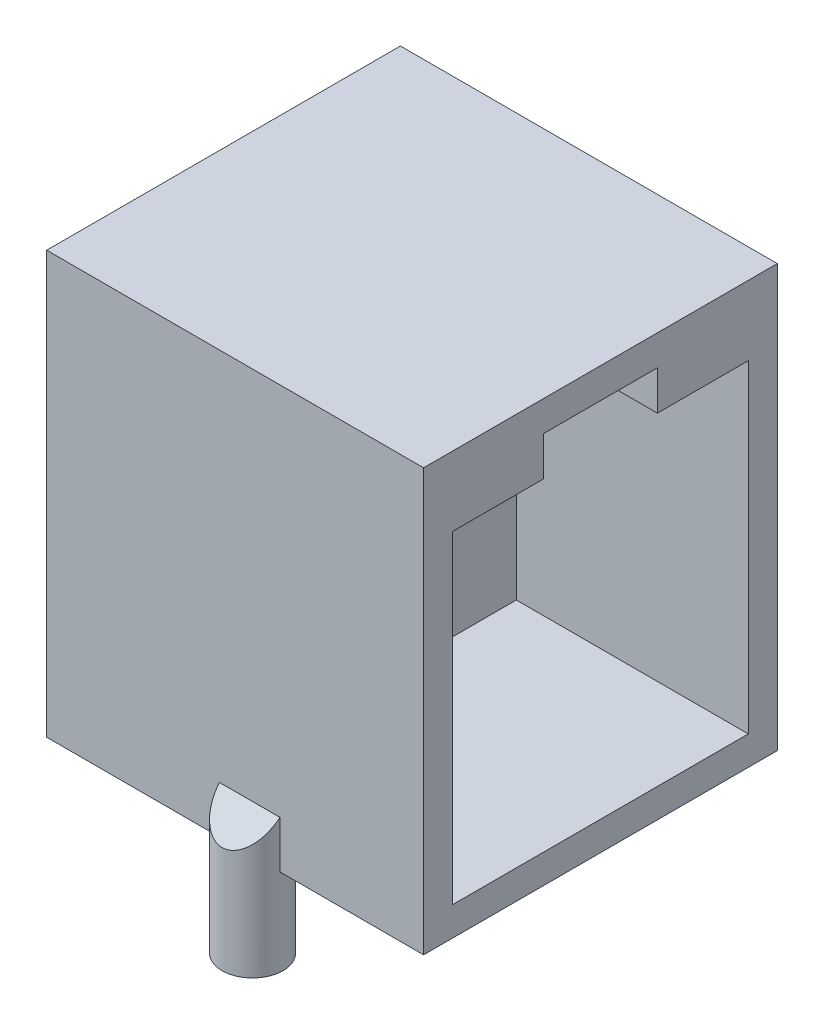
ISO-10303-21;
HEADER;
FILE_DESCRIPTION(('STEP AP214'),'2;1');
FILE_NAME('part.step','',(''),(''),'','','');
FILE_SCHEMA(('AUTOMOTIVE_DESIGN { 1 0 10303 214 1 1 1 1 }'));
ENDSEC;
DATA;
#1=APPLICATION_CONTEXT('core data for automotive mechanical design processes');
#2=APPLICATION_PROTOCOL_DEFINITION('international standard','automotive_design',2000,#1);
#3=PRODUCT_CONTEXT('',#1,'mechanical');
#4=PRODUCT('Part','Part','',(#3));
#5=PRODUCT_RELATED_PRODUCT_CATEGORY('part','',(#4));
#6=PRODUCT_DEFINITION_FORMATION('','',#4);
#7=PRODUCT_DEFINITION_CONTEXT('part definition',#1,'design');
#8=PRODUCT_DEFINITION('design','',#6,#7);
#9=PRODUCT_DEFINITION_SHAPE('','',#8);
#10=(LENGTH_UNIT() NAMED_UNIT(*) SI_UNIT(.MILLI.,.METRE.));
#11=(NAMED_UNIT(*) PLANE_ANGLE_UNIT() SI_UNIT($,.RADIAN.));
#12=(NAMED_UNIT(*) SI_UNIT($,.STERADIAN.) SOLID_ANGLE_UNIT());
#13=UNCERTAINTY_MEASURE_WITH_UNIT(LENGTH_MEASURE(1.E-05),#10,'distance_accuracy_value','');
#14=(GEOMETRIC_REPRESENTATION_CONTEXT(3) GLOBAL_UNCERTAINTY_ASSIGNED_CONTEXT((#13)) GLOBAL_UNIT_ASSIGNED_CONTEXT((#10,
#11,#12)) REPRESENTATION_CONTEXT('',''));
#15=CARTESIAN_POINT('',(0.,0.,0.));
#16=DIRECTION('',(0.,0.,1.));
#17=DIRECTION('',(1.,0.,0.));
#18=AXIS2_PLACEMENT_3D('',#15,#16,#17);
#19=CARTESIAN_POINT('',(0.,14.55,0.));
#20=DIRECTION('',(1.,0.,0.));
#21=DIRECTION('',(0.,0.,-1.));
#22=AXIS2_PLACEMENT_3D('',#19,#20,#21);
#23=PLANE('',#22);
#24=DIRECTION('',(0.,0.,1.));
#25=VECTOR('',#24,1.);
#26=CARTESIAN_POINT('',(0.,0.,0.));
#27=LINE('',#26,#25);
#28=CARTESIAN_POINT('',(0.,0.,-12.2));
#29=VERTEX_POINT('',#28);
#30=CARTESIAN_POINT('',(0.,0.,0.));
#31=VERTEX_POINT('',#30);
#32=EDGE_CURVE('E233',#29,#31,#27,.T.);
#33=ORIENTED_EDGE('',*,*,#32,.T.);
#34=DIRECTION('',(0.,-1.,0.));
#35=VECTOR('',#34,1.);
#36=CARTESIAN_POINT('',(0.,14.55,0.));
#37=LINE('',#36,#35);
#38=CARTESIAN_POINT('',(0.,14.55,0.));
#39=VERTEX_POINT('',#38);
#40=EDGE_CURVE('E238',#39,#31,#37,.T.);
#41=ORIENTED_EDGE('',*,*,#40,.F.);
#42=DIRECTION('',(0.,0.,1.));
#43=VECTOR('',#42,1.);
#44=CARTESIAN_POINT('',(0.,14.55,0.));
#45=LINE('',#44,#43);
#46=CARTESIAN_POINT('',(0.,14.55,-12.2));
#47=VERTEX_POINT('',#46);
#48=EDGE_CURVE('E239',#47,#39,#45,.T.);
#49=ORIENTED_EDGE('',*,*,#48,.F.);
#50=DIRECTION('',(0.,-1.,0.));
#51=VECTOR('',#50,1.);
#52=CARTESIAN_POINT('',(0.,14.55,-12.2));
#53=LINE('',#52,#51);
#54=EDGE_CURVE('E249',#47,#29,#53,.T.);
#55=ORIENTED_EDGE('',*,*,#54,.T.);
#56=EDGE_LOOP('',(#33,#41,#49,#55));
#57=FACE_BOUND('',#56,.T.);
#58=ADVANCED_FACE('F37',(#57),#23,.F.);
#59=CARTESIAN_POINT('',(0.,14.55,0.));
#60=DIRECTION('',(0.,0.,-1.));
#61=DIRECTION('',(-1.,0.,0.));
#62=AXIS2_PLACEMENT_3D('',#59,#60,#61);
#63=PLANE('',#62);
#64=DIRECTION('',(1.,0.,0.));
#65=VECTOR('',#64,1.);
#66=CARTESIAN_POINT('',(8.04522724801834,1.63000000000003,0.));
#67=LINE('',#66,#65);
#68=CARTESIAN_POINT('',(5.95477275198166,1.63000000000003,0.));
#69=VERTEX_POINT('',#68);
#70=CARTESIAN_POINT('',(8.04522724801834,1.63000000000003,0.));
#71=VERTEX_POINT('',#70);
#72=EDGE_CURVE('E271',#69,#71,#67,.T.);
#73=ORIENTED_EDGE('',*,*,#72,.T.);
#74=DIRECTION('',(0.,1.,0.));
#75=VECTOR('',#74,1.);
#76=CARTESIAN_POINT('',(8.04522724801834,1.63000000000003,0.));
#77=LINE('',#76,#75);
#78=CARTESIAN_POINT('',(8.04522724801834,0.,0.));
#79=VERTEX_POINT('',#78);
#80=EDGE_CURVE('E274',#71,#79,#77,.F.);
#81=ORIENTED_EDGE('',*,*,#80,.T.);
#82=DIRECTION('',(1.,0.,0.));
#83=VECTOR('',#82,1.);
#84=CARTESIAN_POINT('',(0.,0.,0.));
#85=LINE('',#84,#83);
#86=CARTESIAN_POINT('',(13.,0.,0.));
#87=VERTEX_POINT('',#86);
#88=EDGE_CURVE('E252',#79,#87,#85,.T.);
#89=ORIENTED_EDGE('',*,*,#88,.T.);
#90=DIRECTION('',(0.,-1.,0.));
#91=VECTOR('',#90,1.);
#92=CARTESIAN_POINT('',(13.,14.55,0.));
#93=LINE('',#92,#91);
#94=CARTESIAN_POINT('',(13.,14.55,0.));
#95=VERTEX_POINT('',#94);
#96=EDGE_CURVE('E265',#95,#87,#93,.T.);
#97=ORIENTED_EDGE('',*,*,#96,.F.);
#98=DIRECTION('',(1.,0.,0.));
#99=VECTOR('',#98,1.);
#100=CARTESIAN_POINT('',(0.,14.55,0.));
#101=LINE('',#100,#99);
#102=EDGE_CURVE('E242',#39,#95,#101,.T.);
#103=ORIENTED_EDGE('',*,*,#102,.F.);
#104=ORIENTED_EDGE('',*,*,#40,.T.);
#105=CARTESIAN_POINT('',(5.95477275198166,0.,0.));
#106=VERTEX_POINT('',#105);
#107=EDGE_CURVE('E253',#31,#106,#85,.T.);
#108=ORIENTED_EDGE('',*,*,#107,.T.);
#109=DIRECTION('',(0.,1.,0.));
#110=VECTOR('',#109,1.);
#111=CARTESIAN_POINT('',(5.95477275198166,0.,0.));
#112=LINE('',#111,#110);
#113=EDGE_CURVE('E237',#106,#69,#112,.T.);
#114=ORIENTED_EDGE('',*,*,#113,.T.);
#115=EDGE_LOOP('',(#73,#81,#89,#97,#103,#104,#108,#114));
#116=FACE_BOUND('',#115,.T.);
#117=ADVANCED_FACE('F315',(#116),#63,.F.);
#118=CARTESIAN_POINT('',(13.,14.55,0.));
#119=DIRECTION('',(-1.,0.,0.));
#120=DIRECTION('',(0.,0.,1.));
#121=AXIS2_PLACEMENT_3D('',#118,#119,#120);
#122=PLANE('',#121);
#123=DIRECTION('',(0.,1.,0.));
#124=VECTOR('',#123,1.);
#125=CARTESIAN_POINT('',(13.,13.5034894813453,-8.06507473634951));
#126=LINE('',#125,#124);
#127=CARTESIAN_POINT('',(13.,12.1496378925986,-8.06507473634951));
#128=VERTEX_POINT('',#127);
#129=CARTESIAN_POINT('',(13.,13.5034894813453,-8.06507473634951));
#130=VERTEX_POINT('',#129);
#131=EDGE_CURVE('E196',#128,#130,#126,.T.);
#132=ORIENTED_EDGE('',*,*,#131,.F.);
#133=DIRECTION('',(0.,0.,1.));
#134=VECTOR('',#133,1.);
#135=CARTESIAN_POINT('',(13.,12.1496378925986,-8.06507473634951));
#136=LINE('',#135,#134);
#137=CARTESIAN_POINT('',(13.,12.1496378925986,-11.1997281323746));
#138=VERTEX_POINT('',#137);
#139=EDGE_CURVE('E158',#138,#128,#136,.T.);
#140=ORIENTED_EDGE('',*,*,#139,.F.);
#141=DIRECTION('',(0.,1.,0.));
#142=VECTOR('',#141,1.);
#143=CARTESIAN_POINT('',(13.,1.0002718676254,-11.1997281323746));
#144=LINE('',#143,#142);
#145=CARTESIAN_POINT('',(13.,1.0002718676254,-11.1997281323746));
#146=VERTEX_POINT('',#145);
#147=EDGE_CURVE('E176',#146,#138,#144,.T.);
#148=ORIENTED_EDGE('',*,*,#147,.F.);
#149=DIRECTION('',(0.,0.,-1.));
#150=VECTOR('',#149,1.);
#151=CARTESIAN_POINT('',(13.,1.0002718676254,-1.0002718676254));
#152=LINE('',#151,#150);
#153=CARTESIAN_POINT('',(13.,1.0002718676254,-1.0002718676254));
#154=VERTEX_POINT('',#153);
#155=EDGE_CURVE('E179',#154,#146,#152,.T.);
#156=ORIENTED_EDGE('',*,*,#155,.F.);
#157=DIRECTION('',(0.,-1.,0.));
#158=VECTOR('',#157,1.);
#159=CARTESIAN_POINT('',(13.,12.1496378925986,-1.0002718676254));
#160=LINE('',#159,#158);
#161=CARTESIAN_POINT('',(13.,12.1496378925986,-1.0002718676254));
#162=VERTEX_POINT('',#161);
#163=EDGE_CURVE('E207',#162,#154,#160,.T.);
#164=ORIENTED_EDGE('',*,*,#163,.F.);
#165=DIRECTION('',(0.,0.,1.));
#166=VECTOR('',#165,1.);
#167=CARTESIAN_POINT('',(13.,12.1496378925986,-1.0002718676254));
#168=LINE('',#167,#166);
#169=CARTESIAN_POINT('',(13.,12.1496378925986,-4.13492526365049));
#170=VERTEX_POINT('',#169);
#171=EDGE_CURVE('E204',#170,#162,#168,.T.);
#172=ORIENTED_EDGE('',*,*,#171,.F.);
#173=DIRECTION('',(0.,-1.,0.));
#174=VECTOR('',#173,1.);
#175=CARTESIAN_POINT('',(13.,12.1496378925986,-4.13492526365049));
#176=LINE('',#175,#174);
#177=CARTESIAN_POINT('',(13.,13.5034894813453,-4.13492526365049));
#178=VERTEX_POINT('',#177);
#179=EDGE_CURVE('E201',#178,#170,#176,.T.);
#180=ORIENTED_EDGE('',*,*,#179,.F.);
#181=DIRECTION('',(0.,0.,1.));
#182=VECTOR('',#181,1.);
#183=CARTESIAN_POINT('',(13.,13.5034894813453,-4.13492526365049));
#184=LINE('',#183,#182);
#185=EDGE_CURVE('E198',#130,#178,#184,.T.);
#186=ORIENTED_EDGE('',*,*,#185,.F.);
#187=EDGE_LOOP('',(#132,#140,#148,#156,#164,#172,#180,#186));
#188=FACE_BOUND('',#187,.T.);
#189=DIRECTION('',(0.,0.,-1.));
#190=VECTOR('',#189,1.);
#191=CARTESIAN_POINT('',(13.,0.,0.));
#192=LINE('',#191,#190);
#193=CARTESIAN_POINT('',(13.,0.,-12.2));
#194=VERTEX_POINT('',#193);
#195=EDGE_CURVE('E256',#87,#194,#192,.T.);
#196=ORIENTED_EDGE('',*,*,#195,.T.);
#197=DIRECTION('',(0.,-1.,0.));
#198=VECTOR('',#197,1.);
#199=CARTESIAN_POINT('',(13.,14.55,-12.2));
#200=LINE('',#199,#198);
#201=CARTESIAN_POINT('',(13.,14.55,-12.2));
#202=VERTEX_POINT('',#201);
#203=EDGE_CURVE('E262',#202,#194,#200,.T.);
#204=ORIENTED_EDGE('',*,*,#203,.F.);
#205=DIRECTION('',(0.,0.,-1.));
#206=VECTOR('',#205,1.);
#207=CARTESIAN_POINT('',(13.,14.55,0.));
#208=LINE('',#207,#206);
#209=EDGE_CURVE('E245',#95,#202,#208,.T.);
#210=ORIENTED_EDGE('',*,*,#209,.F.);
#211=ORIENTED_EDGE('',*,*,#96,.T.);
#212=EDGE_LOOP('',(#196,#204,#210,#211));
#213=FACE_BOUND('',#212,.T.);
#214=ADVANCED_FACE('F304',(#188,#213),#122,.F.);
#215=CARTESIAN_POINT('',(0.,14.55,-12.2));
#216=DIRECTION('',(0.,0.,1.));
#217=DIRECTION('',(1.,0.,0.));
#218=AXIS2_PLACEMENT_3D('',#215,#216,#217);
#219=PLANE('',#218);
#220=DIRECTION('',(-1.,0.,0.));
#221=VECTOR('',#220,1.);
#222=CARTESIAN_POINT('',(5.95477275198166,1.63000000000003,-12.2));
#223=LINE('',#222,#221);
#224=CARTESIAN_POINT('',(8.04522724801835,1.63000000000003,-12.2));
#225=VERTEX_POINT('',#224);
#226=CARTESIAN_POINT('',(5.95477275198166,1.63000000000003,-12.2));
#227=VERTEX_POINT('',#226);
#228=EDGE_CURVE('E277',#225,#227,#223,.T.);
#229=ORIENTED_EDGE('',*,*,#228,.T.);
#230=DIRECTION('',(0.,1.,0.));
#231=VECTOR('',#230,1.);
#232=CARTESIAN_POINT('',(5.95477275198166,1.63000000000003,-12.2));
#233=LINE('',#232,#231);
#234=CARTESIAN_POINT('',(5.95477275198166,0.,-12.2));
#235=VERTEX_POINT('',#234);
#236=EDGE_CURVE('E280',#227,#235,#233,.F.);
#237=ORIENTED_EDGE('',*,*,#236,.T.);
#238=DIRECTION('',(-1.,0.,0.));
#239=VECTOR('',#238,1.);
#240=CARTESIAN_POINT('',(0.,0.,-12.2));
#241=LINE('',#240,#239);
#242=EDGE_CURVE('E258',#235,#29,#241,.T.);
#243=ORIENTED_EDGE('',*,*,#242,.T.);
#244=ORIENTED_EDGE('',*,*,#54,.F.);
#245=DIRECTION('',(-1.,0.,0.));
#246=VECTOR('',#245,1.);
#247=CARTESIAN_POINT('',(0.,14.55,-12.2));
#248=LINE('',#247,#246);
#249=EDGE_CURVE('E247',#202,#47,#248,.T.);
#250=ORIENTED_EDGE('',*,*,#249,.F.);
#251=ORIENTED_EDGE('',*,*,#203,.T.);
#252=CARTESIAN_POINT('',(8.04522724801835,0.,-12.2));
#253=VERTEX_POINT('',#252);
#254=EDGE_CURVE('E243',#194,#253,#241,.T.);
#255=ORIENTED_EDGE('',*,*,#254,.T.);
#256=DIRECTION('',(0.,1.,0.));
#257=VECTOR('',#256,1.);
#258=CARTESIAN_POINT('',(8.04522724801835,0.,-12.2));
#259=LINE('',#258,#257);
#260=EDGE_CURVE('E54',#253,#225,#259,.T.);
#261=ORIENTED_EDGE('',*,*,#260,.T.);
#262=EDGE_LOOP('',(#229,#237,#243,#244,#250,#251,#255,#261));
#263=FACE_BOUND('',#262,.T.);
#264=ADVANCED_FACE('F283',(#263),#219,.F.);
#265=CARTESIAN_POINT('',(0.,14.55,0.));
#266=DIRECTION('',(0.,-1.,0.));
#267=DIRECTION('',(0.,0.,-1.));
#268=AXIS2_PLACEMENT_3D('',#265,#266,#267);
#269=PLANE('',#268);
#270=ORIENTED_EDGE('',*,*,#48,.T.);
#271=ORIENTED_EDGE('',*,*,#102,.T.);
#272=ORIENTED_EDGE('',*,*,#209,.T.);
#273=ORIENTED_EDGE('',*,*,#249,.T.);
#274=EDGE_LOOP('',(#270,#271,#272,#273));
#275=FACE_BOUND('',#274,.T.);
#276=ADVANCED_FACE('F300',(#275),#269,.F.);
#277=CARTESIAN_POINT('',(0.,0.,0.));
#278=DIRECTION('',(0.,-1.,0.));
#279=DIRECTION('',(0.,0.,-1.));
#280=AXIS2_PLACEMENT_3D('',#277,#278,#279);
#281=PLANE('',#280);
#282=ORIENTED_EDGE('',*,*,#242,.F.);
#283=CARTESIAN_POINT('',(7.,0.,-12.1));
#284=DIRECTION('',(0.,-1.,0.));
#285=DIRECTION('',(0.,0.,-1.));
#286=AXIS2_PLACEMENT_3D('',#283,#284,#285);
#287=CIRCLE('',#286,1.05);
#288=EDGE_CURVE('E214',#253,#235,#287,.T.);
#289=ORIENTED_EDGE('',*,*,#288,.F.);
#290=ORIENTED_EDGE('',*,*,#254,.F.);
#291=ORIENTED_EDGE('',*,*,#195,.F.);
#292=ORIENTED_EDGE('',*,*,#88,.F.);
#293=CARTESIAN_POINT('',(7.,0.,-0.0999999999999994));
#294=DIRECTION('',(0.,-1.,0.));
#295=DIRECTION('',(0.,0.,-1.));
#296=AXIS2_PLACEMENT_3D('',#293,#294,#295);
#297=CIRCLE('',#296,1.05);
#298=EDGE_CURVE('E234',#106,#79,#297,.T.);
#299=ORIENTED_EDGE('',*,*,#298,.F.);
#300=ORIENTED_EDGE('',*,*,#107,.F.);
#301=ORIENTED_EDGE('',*,*,#32,.F.);
#302=EDGE_LOOP('',(#282,#289,#290,#291,#292,#299,#300,#301));
#303=FACE_BOUND('',#302,.T.);
#304=ADVANCED_FACE('F292',(#303),#281,.T.);
#305=CARTESIAN_POINT('',(7.,-3.,-0.0999999999999994));
#306=DIRECTION('',(0.,1.,0.));
#307=DIRECTION('',(0.,0.,1.));
#308=AXIS2_PLACEMENT_3D('',#305,#306,#307);
#309=CYLINDRICAL_SURFACE('',#308,1.05);
#310=CARTESIAN_POINT('',(7.,-3.,-0.0999999999999994));
#311=DIRECTION('',(0.,-1.,0.));
#312=DIRECTION('',(0.,0.,-1.));
#313=AXIS2_PLACEMENT_3D('',#310,#311,#312);
#314=CIRCLE('',#313,1.05);
#315=CARTESIAN_POINT('',(7.,-3.,-1.15));
#316=VERTEX_POINT('',#315);
#317=EDGE_CURVE('E229',#316,#316,#314,.T.);
#318=ORIENTED_EDGE('',*,*,#317,.F.);
#319=EDGE_LOOP('',(#318));
#320=FACE_BOUND('',#319,.T.);
#321=ORIENTED_EDGE('',*,*,#80,.F.);
#322=CARTESIAN_POINT('',(7.,1.73000000000003,-0.0999999999999994));
#323=DIRECTION('',(0.,0.707106781186544,0.707106781186551));
#324=DIRECTION('',(0.,0.707106781186551,-0.707106781186544));
#325=AXIS2_PLACEMENT_3D('',#322,#323,#324);
#326=ELLIPSE('',#325,1.48492424049176,1.05);
#327=EDGE_CURVE('E47',#71,#69,#326,.F.);
#328=ORIENTED_EDGE('',*,*,#327,.T.);
#329=ORIENTED_EDGE('',*,*,#113,.F.);
#330=ORIENTED_EDGE('',*,*,#298,.T.);
#331=EDGE_LOOP('',(#321,#328,#329,#330));
#332=FACE_BOUND('',#331,.T.);
#333=ADVANCED_FACE('F335',(#320,#332),#309,.T.);
#334=CARTESIAN_POINT('',(7.,-3.,-0.0999999999999994));
#335=DIRECTION('',(0.,-1.,0.));
#336=DIRECTION('',(0.,0.,-1.));
#337=AXIS2_PLACEMENT_3D('',#334,#335,#336);
#338=PLANE('',#337);
#339=ORIENTED_EDGE('',*,*,#317,.T.);
#340=EDGE_LOOP('',(#339));
#341=FACE_BOUND('',#340,.T.);
#342=ADVANCED_FACE('F340',(#341),#338,.T.);
#343=CARTESIAN_POINT('',(7.,-3.,-12.1));
#344=DIRECTION('',(0.,1.,0.));
#345=DIRECTION('',(0.,0.,1.));
#346=AXIS2_PLACEMENT_3D('',#343,#344,#345);
#347=CYLINDRICAL_SURFACE('',#346,1.05);
#348=CARTESIAN_POINT('',(7.,-3.,-12.1));
#349=DIRECTION('',(0.,-1.,0.));
#350=DIRECTION('',(0.,0.,-1.));
#351=AXIS2_PLACEMENT_3D('',#348,#349,#350);
#352=CIRCLE('',#351,1.05);
#353=CARTESIAN_POINT('',(7.,-3.,-13.15));
#354=VERTEX_POINT('',#353);
#355=EDGE_CURVE('E226',#354,#354,#352,.T.);
#356=ORIENTED_EDGE('',*,*,#355,.F.);
#357=EDGE_LOOP('',(#356));
#358=FACE_BOUND('',#357,.T.);
#359=ORIENTED_EDGE('',*,*,#288,.T.);
#360=ORIENTED_EDGE('',*,*,#236,.F.);
#361=CARTESIAN_POINT('',(7.,1.73000000000003,-12.1));
#362=DIRECTION('',(0.,0.707106781186544,-0.707106781186551));
#363=DIRECTION('',(0.,0.707106781186551,0.707106781186544));
#364=AXIS2_PLACEMENT_3D('',#361,#362,#363);
#365=ELLIPSE('',#364,1.48492424049176,1.05);
#366=EDGE_CURVE('E11',#227,#225,#365,.F.);
#367=ORIENTED_EDGE('',*,*,#366,.T.);
#368=ORIENTED_EDGE('',*,*,#260,.F.);
#369=EDGE_LOOP('',(#359,#360,#367,#368));
#370=FACE_BOUND('',#369,.T.);
#371=ADVANCED_FACE('F288',(#358,#370),#347,.T.);
#372=CARTESIAN_POINT('',(7.,-3.,-12.1));
#373=DIRECTION('',(0.,-1.,0.));
#374=DIRECTION('',(0.,0.,-1.));
#375=AXIS2_PLACEMENT_3D('',#372,#373,#374);
#376=PLANE('',#375);
#377=ORIENTED_EDGE('',*,*,#355,.T.);
#378=EDGE_LOOP('',(#377));
#379=FACE_BOUND('',#378,.T.);
#380=ADVANCED_FACE('F347',(#379),#376,.T.);
#381=CARTESIAN_POINT('',(5.,12.1496378925986,-8.06507473634951));
#382=DIRECTION('',(0.,1.,0.));
#383=DIRECTION('',(0.,0.,1.));
#384=AXIS2_PLACEMENT_3D('',#381,#382,#383);
#385=PLANE('',#384);
#386=ORIENTED_EDGE('',*,*,#139,.T.);
#387=DIRECTION('',(1.,0.,0.));
#388=VECTOR('',#387,1.);
#389=CARTESIAN_POINT('',(5.,12.1496378925986,-8.06507473634951));
#390=LINE('',#389,#388);
#391=CARTESIAN_POINT('',(5.,12.1496378925986,-8.06507473634951));
#392=VERTEX_POINT('',#391);
#393=EDGE_CURVE('E151',#392,#128,#390,.T.);
#394=ORIENTED_EDGE('',*,*,#393,.F.);
#395=DIRECTION('',(0.,0.,1.));
#396=VECTOR('',#395,1.);
#397=CARTESIAN_POINT('',(5.,12.1496378925986,-8.06507473634951));
#398=LINE('',#397,#396);
#399=CARTESIAN_POINT('',(5.,12.1496378925986,-11.1997281323746));
#400=VERTEX_POINT('',#399);
#401=EDGE_CURVE('E155',#400,#392,#398,.T.);
#402=ORIENTED_EDGE('',*,*,#401,.F.);
#403=DIRECTION('',(1.,0.,0.));
#404=VECTOR('',#403,1.);
#405=CARTESIAN_POINT('',(5.,12.1496378925986,-11.1997281323746));
#406=LINE('',#405,#404);
#407=EDGE_CURVE('E212',#400,#138,#406,.T.);
#408=ORIENTED_EDGE('',*,*,#407,.T.);
#409=EDGE_LOOP('',(#386,#394,#402,#408));
#410=FACE_BOUND('',#409,.T.);
#411=ADVANCED_FACE('F153',(#410),#385,.F.);
#412=CARTESIAN_POINT('',(5.,1.0002718676254,-11.1997281323746));
#413=DIRECTION('',(0.,0.,-1.));
#414=DIRECTION('',(-1.,0.,0.));
#415=AXIS2_PLACEMENT_3D('',#412,#413,#414);
#416=PLANE('',#415);
#417=ORIENTED_EDGE('',*,*,#147,.T.);
#418=ORIENTED_EDGE('',*,*,#407,.F.);
#419=DIRECTION('',(0.,1.,0.));
#420=VECTOR('',#419,1.);
#421=CARTESIAN_POINT('',(5.,1.0002718676254,-11.1997281323746));
#422=LINE('',#421,#420);
#423=CARTESIAN_POINT('',(5.,1.0002718676254,-11.1997281323746));
#424=VERTEX_POINT('',#423);
#425=EDGE_CURVE('E163',#424,#400,#422,.T.);
#426=ORIENTED_EDGE('',*,*,#425,.F.);
#427=DIRECTION('',(1.,0.,0.));
#428=VECTOR('',#427,1.);
#429=CARTESIAN_POINT('',(5.,1.0002718676254,-11.1997281323746));
#430=LINE('',#429,#428);
#431=EDGE_CURVE('E215',#424,#146,#430,.T.);
#432=ORIENTED_EDGE('',*,*,#431,.T.);
#433=EDGE_LOOP('',(#417,#418,#426,#432));
#434=FACE_BOUND('',#433,.T.);
#435=ADVANCED_FACE('F354',(#434),#416,.F.);
#436=CARTESIAN_POINT('',(5.,1.0002718676254,-1.0002718676254));
#437=DIRECTION('',(0.,-1.,0.));
#438=DIRECTION('',(0.,0.,-1.));
#439=AXIS2_PLACEMENT_3D('',#436,#437,#438);
#440=PLANE('',#439);
#441=ORIENTED_EDGE('',*,*,#155,.T.);
#442=ORIENTED_EDGE('',*,*,#431,.F.);
#443=DIRECTION('',(0.,0.,-1.));
#444=VECTOR('',#443,1.);
#445=CARTESIAN_POINT('',(5.,1.0002718676254,-1.0002718676254));
#446=LINE('',#445,#444);
#447=CARTESIAN_POINT('',(5.,1.0002718676254,-1.0002718676254));
#448=VERTEX_POINT('',#447);
#449=EDGE_CURVE('E192',#448,#424,#446,.T.);
#450=ORIENTED_EDGE('',*,*,#449,.F.);
#451=DIRECTION('',(1.,0.,0.));
#452=VECTOR('',#451,1.);
#453=CARTESIAN_POINT('',(5.,1.0002718676254,-1.0002718676254));
#454=LINE('',#453,#452);
#455=EDGE_CURVE('E217',#448,#154,#454,.T.);
#456=ORIENTED_EDGE('',*,*,#455,.T.);
#457=EDGE_LOOP('',(#441,#442,#450,#456));
#458=FACE_BOUND('',#457,.T.);
#459=ADVANCED_FACE('F372',(#458),#440,.F.);
#460=CARTESIAN_POINT('',(5.,12.1496378925986,-1.0002718676254));
#461=DIRECTION('',(0.,0.,1.));
#462=DIRECTION('',(0.,-1.,0.));
#463=AXIS2_PLACEMENT_3D('',#460,#461,#462);
#464=PLANE('',#463);
#465=ORIENTED_EDGE('',*,*,#163,.T.);
#466=ORIENTED_EDGE('',*,*,#455,.F.);
#467=DIRECTION('',(0.,-1.,0.));
#468=VECTOR('',#467,1.);
#469=CARTESIAN_POINT('',(5.,12.1496378925986,-1.0002718676254));
#470=LINE('',#469,#468);
#471=CARTESIAN_POINT('',(5.,12.1496378925986,-1.0002718676254));
#472=VERTEX_POINT('',#471);
#473=EDGE_CURVE('E189',#472,#448,#470,.T.);
#474=ORIENTED_EDGE('',*,*,#473,.F.);
#475=DIRECTION('',(1.,0.,0.));
#476=VECTOR('',#475,1.);
#477=CARTESIAN_POINT('',(5.,12.1496378925986,-1.0002718676254));
#478=LINE('',#477,#476);
#479=EDGE_CURVE('E219',#472,#162,#478,.T.);
#480=ORIENTED_EDGE('',*,*,#479,.T.);
#481=EDGE_LOOP('',(#465,#466,#474,#480));
#482=FACE_BOUND('',#481,.T.);
#483=ADVANCED_FACE('F368',(#482),#464,.F.);
#484=CARTESIAN_POINT('',(5.,12.1496378925986,-1.0002718676254));
#485=DIRECTION('',(0.,1.,0.));
#486=DIRECTION('',(0.,0.,1.));
#487=AXIS2_PLACEMENT_3D('',#484,#485,#486);
#488=PLANE('',#487);
#489=ORIENTED_EDGE('',*,*,#171,.T.);
#490=ORIENTED_EDGE('',*,*,#479,.F.);
#491=DIRECTION('',(0.,0.,1.));
#492=VECTOR('',#491,1.);
#493=CARTESIAN_POINT('',(5.,12.1496378925986,-1.0002718676254));
#494=LINE('',#493,#492);
#495=CARTESIAN_POINT('',(5.,12.1496378925986,-4.13492526365049));
#496=VERTEX_POINT('',#495);
#497=EDGE_CURVE('E186',#496,#472,#494,.T.);
#498=ORIENTED_EDGE('',*,*,#497,.F.);
#499=DIRECTION('',(1.,0.,0.));
#500=VECTOR('',#499,1.);
#501=CARTESIAN_POINT('',(5.,12.1496378925986,-4.13492526365049));
#502=LINE('',#501,#500);
#503=EDGE_CURVE('E221',#496,#170,#502,.T.);
#504=ORIENTED_EDGE('',*,*,#503,.T.);
#505=EDGE_LOOP('',(#489,#490,#498,#504));
#506=FACE_BOUND('',#505,.T.);
#507=ADVANCED_FACE('F364',(#506),#488,.F.);
#508=CARTESIAN_POINT('',(5.,12.1496378925986,-4.13492526365049));
#509=DIRECTION('',(0.,0.,1.));
#510=DIRECTION('',(1.,0.,0.));
#511=AXIS2_PLACEMENT_3D('',#508,#509,#510);
#512=PLANE('',#511);
#513=ORIENTED_EDGE('',*,*,#179,.T.);
#514=ORIENTED_EDGE('',*,*,#503,.F.);
#515=DIRECTION('',(0.,-1.,0.));
#516=VECTOR('',#515,1.);
#517=CARTESIAN_POINT('',(5.,12.1496378925986,-4.13492526365049));
#518=LINE('',#517,#516);
#519=CARTESIAN_POINT('',(5.,13.5034894813453,-4.13492526365049));
#520=VERTEX_POINT('',#519);
#521=EDGE_CURVE('E183',#520,#496,#518,.T.);
#522=ORIENTED_EDGE('',*,*,#521,.F.);
#523=DIRECTION('',(1.,0.,0.));
#524=VECTOR('',#523,1.);
#525=CARTESIAN_POINT('',(5.,13.5034894813453,-4.13492526365049));
#526=LINE('',#525,#524);
#527=EDGE_CURVE('E223',#520,#178,#526,.T.);
#528=ORIENTED_EDGE('',*,*,#527,.T.);
#529=EDGE_LOOP('',(#513,#514,#522,#528));
#530=FACE_BOUND('',#529,.T.);
#531=ADVANCED_FACE('F360',(#530),#512,.F.);
#532=CARTESIAN_POINT('',(5.,13.5034894813453,-4.13492526365049));
#533=DIRECTION('',(0.,1.,0.));
#534=DIRECTION('',(0.,0.,1.));
#535=AXIS2_PLACEMENT_3D('',#532,#533,#534);
#536=PLANE('',#535);
#537=ORIENTED_EDGE('',*,*,#185,.T.);
#538=ORIENTED_EDGE('',*,*,#527,.F.);
#539=DIRECTION('',(0.,0.,1.));
#540=VECTOR('',#539,1.);
#541=CARTESIAN_POINT('',(5.,13.5034894813453,-4.13492526365049));
#542=LINE('',#541,#540);
#543=CARTESIAN_POINT('',(5.,13.5034894813453,-8.06507473634951));
#544=VERTEX_POINT('',#543);
#545=EDGE_CURVE('E171',#544,#520,#542,.T.);
#546=ORIENTED_EDGE('',*,*,#545,.F.);
#547=DIRECTION('',(1.,0.,0.));
#548=VECTOR('',#547,1.);
#549=CARTESIAN_POINT('',(5.,13.5034894813453,-8.06507473634951));
#550=LINE('',#549,#548);
#551=EDGE_CURVE('E162',#544,#130,#550,.T.);
#552=ORIENTED_EDGE('',*,*,#551,.T.);
#553=EDGE_LOOP('',(#537,#538,#546,#552));
#554=FACE_BOUND('',#553,.T.);
#555=ADVANCED_FACE('F357',(#554),#536,.F.);
#556=CARTESIAN_POINT('',(5.,13.5034894813453,-8.06507473634951));
#557=DIRECTION('',(0.,0.,-1.));
#558=DIRECTION('',(-1.,0.,0.));
#559=AXIS2_PLACEMENT_3D('',#556,#557,#558);
#560=PLANE('',#559);
#561=ORIENTED_EDGE('',*,*,#131,.T.);
#562=ORIENTED_EDGE('',*,*,#551,.F.);
#563=DIRECTION('',(0.,1.,0.));
#564=VECTOR('',#563,1.);
#565=CARTESIAN_POINT('',(5.,13.5034894813453,-8.06507473634951));
#566=LINE('',#565,#564);
#567=EDGE_CURVE('E166',#392,#544,#566,.T.);
#568=ORIENTED_EDGE('',*,*,#567,.F.);
#569=ORIENTED_EDGE('',*,*,#393,.T.);
#570=EDGE_LOOP('',(#561,#562,#568,#569));
#571=FACE_BOUND('',#570,.T.);
#572=ADVANCED_FACE('F167',(#571),#560,.F.);
#573=CARTESIAN_POINT('',(5.,0.,0.));
#574=DIRECTION('',(1.,0.,0.));
#575=DIRECTION('',(0.,0.,-1.));
#576=AXIS2_PLACEMENT_3D('',#573,#574,#575);
#577=PLANE('',#576);
#578=ORIENTED_EDGE('',*,*,#401,.T.);
#579=ORIENTED_EDGE('',*,*,#567,.T.);
#580=ORIENTED_EDGE('',*,*,#545,.T.);
#581=ORIENTED_EDGE('',*,*,#521,.T.);
#582=ORIENTED_EDGE('',*,*,#497,.T.);
#583=ORIENTED_EDGE('',*,*,#473,.T.);
#584=ORIENTED_EDGE('',*,*,#449,.T.);
#585=ORIENTED_EDGE('',*,*,#425,.T.);
#586=EDGE_LOOP('',(#578,#579,#580,#581,#582,#583,#584,#585));
#587=FACE_BOUND('',#586,.T.);
#588=ADVANCED_FACE('F173',(#587),#577,.T.);
#589=CARTESIAN_POINT('',(0.,1.63000000000003,0.));
#590=DIRECTION('',(0.,0.707106781186544,0.707106781186551));
#591=DIRECTION('',(-1.,0.,0.));
#592=AXIS2_PLACEMENT_3D('',#589,#590,#591);
#593=PLANE('',#592);
#594=ORIENTED_EDGE('',*,*,#72,.F.);
#595=ORIENTED_EDGE('',*,*,#327,.F.);
#596=EDGE_LOOP('',(#594,#595));
#597=FACE_BOUND('',#596,.T.);
#598=ADVANCED_FACE('F310',(#597),#593,.T.);
#599=CARTESIAN_POINT('',(0.,1.63000000000003,-12.2));
#600=DIRECTION('',(0.,0.707106781186544,-0.707106781186551));
#601=DIRECTION('',(1.,0.,0.));
#602=AXIS2_PLACEMENT_3D('',#599,#600,#601);
#603=PLANE('',#602);
#604=ORIENTED_EDGE('',*,*,#228,.F.);
#605=ORIENTED_EDGE('',*,*,#366,.F.);
#606=EDGE_LOOP('',(#604,#605));
#607=FACE_BOUND('',#606,.T.);
#608=ADVANCED_FACE('F40',(#607),#603,.T.);
#609=CLOSED_SHELL('',(#58,#117,#214,#264,#276,#304,#333,#342,#371,#380,#411,#435,#459,#483,#507,
#531,#555,#572,#588,#598,#608));
#610=MANIFOLD_SOLID_BREP('B2',#609);
#611=ADVANCED_BREP_SHAPE_REPRESENTATION('',(#18,#610),#14);
#612=SHAPE_DEFINITION_REPRESENTATION(#9,#611);
ENDSEC;
END-ISO-10303-21;
